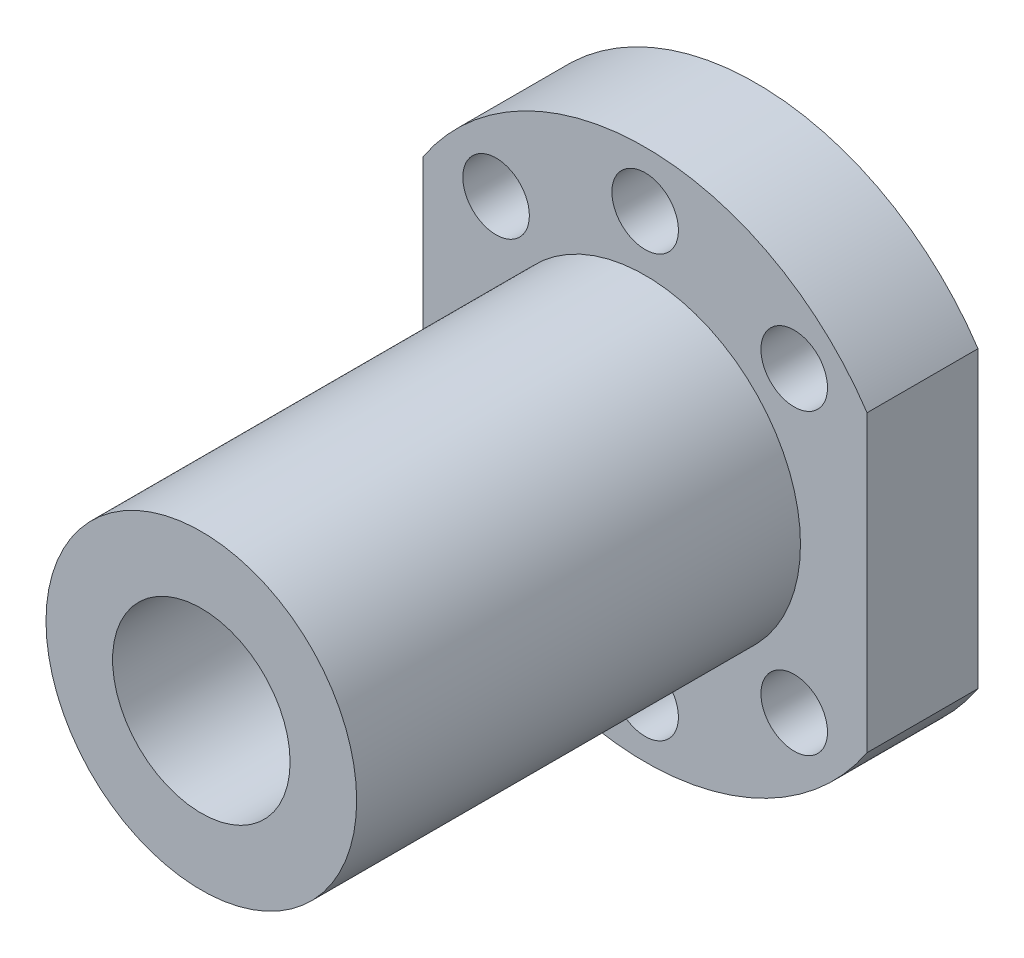
ISO-10303-21;
HEADER;
FILE_DESCRIPTION(('STEP AP214'),'2;1');
FILE_NAME('part.step','',(''),(''),'','','');
FILE_SCHEMA(('AUTOMOTIVE_DESIGN { 1 0 10303 214 1 1 1 1 }'));
ENDSEC;
DATA;
#1=APPLICATION_CONTEXT('core data for automotive mechanical design processes');
#2=APPLICATION_PROTOCOL_DEFINITION('international standard','automotive_design',2000,#1);
#3=PRODUCT_CONTEXT('',#1,'mechanical');
#4=PRODUCT('Part','Part','',(#3));
#5=PRODUCT_RELATED_PRODUCT_CATEGORY('part','',(#4));
#6=PRODUCT_DEFINITION_FORMATION('','',#4);
#7=PRODUCT_DEFINITION_CONTEXT('part definition',#1,'design');
#8=PRODUCT_DEFINITION('design','',#6,#7);
#9=PRODUCT_DEFINITION_SHAPE('','',#8);
#10=(LENGTH_UNIT() NAMED_UNIT(*) SI_UNIT(.MILLI.,.METRE.));
#11=(NAMED_UNIT(*) PLANE_ANGLE_UNIT() SI_UNIT($,.RADIAN.));
#12=(NAMED_UNIT(*) SI_UNIT($,.STERADIAN.) SOLID_ANGLE_UNIT());
#13=UNCERTAINTY_MEASURE_WITH_UNIT(LENGTH_MEASURE(1.E-05),#10,'distance_accuracy_value','');
#14=(GEOMETRIC_REPRESENTATION_CONTEXT(3) GLOBAL_UNCERTAINTY_ASSIGNED_CONTEXT((#13)) GLOBAL_UNIT_ASSIGNED_CONTEXT((#10,
#11,#12)) REPRESENTATION_CONTEXT('',''));
#15=CARTESIAN_POINT('',(0.,0.,0.));
#16=DIRECTION('',(0.,0.,1.));
#17=DIRECTION('',(1.,0.,0.));
#18=AXIS2_PLACEMENT_3D('',#15,#16,#17);
#19=CARTESIAN_POINT('',(-20.,-48.7410098318613,10.));
#20=DIRECTION('',(-1.,0.,0.));
#21=DIRECTION('',(0.,0.,1.));
#22=AXIS2_PLACEMENT_3D('',#19,#20,#21);
#23=PLANE('',#22);
#24=DIRECTION('',(0.,1.,0.));
#25=VECTOR('',#24,1.);
#26=CARTESIAN_POINT('',(-20.,-48.7410098318613,0.));
#27=LINE('',#26,#25);
#28=CARTESIAN_POINT('',(-20.,-13.2664991614216,0.));
#29=VERTEX_POINT('',#28);
#30=CARTESIAN_POINT('',(-20.,13.2664991614216,0.));
#31=VERTEX_POINT('',#30);
#32=EDGE_CURVE('E84',#29,#31,#27,.T.);
#33=ORIENTED_EDGE('',*,*,#32,.F.);
#34=DIRECTION('',(0.,0.,-1.));
#35=VECTOR('',#34,1.);
#36=CARTESIAN_POINT('',(-20.,-13.2664991614216,10.));
#37=LINE('',#36,#35);
#38=CARTESIAN_POINT('',(-20.,-13.2664991614216,10.));
#39=VERTEX_POINT('',#38);
#40=EDGE_CURVE('E11',#39,#29,#37,.T.);
#41=ORIENTED_EDGE('',*,*,#40,.F.);
#42=DIRECTION('',(0.,1.,0.));
#43=VECTOR('',#42,1.);
#44=CARTESIAN_POINT('',(-20.,-48.7410098318613,10.));
#45=LINE('',#44,#43);
#46=CARTESIAN_POINT('',(-20.,13.2664991614216,10.));
#47=VERTEX_POINT('',#46);
#48=EDGE_CURVE('E117',#39,#47,#45,.T.);
#49=ORIENTED_EDGE('',*,*,#48,.T.);
#50=DIRECTION('',(0.,0.,-1.));
#51=VECTOR('',#50,1.);
#52=CARTESIAN_POINT('',(-20.,13.2664991614216,10.));
#53=LINE('',#52,#51);
#54=EDGE_CURVE('E87',#47,#31,#53,.T.);
#55=ORIENTED_EDGE('',*,*,#54,.T.);
#56=EDGE_LOOP('',(#33,#41,#49,#55));
#57=FACE_BOUND('',#56,.T.);
#58=ADVANCED_FACE('F31',(#57),#23,.T.);
#59=CARTESIAN_POINT('',(0.,0.,10.));
#60=DIRECTION('',(0.,0.,-1.));
#61=DIRECTION('',(-1.,0.,0.));
#62=AXIS2_PLACEMENT_3D('',#59,#60,#61);
#63=CYLINDRICAL_SURFACE('',#62,24.);
#64=CARTESIAN_POINT('',(0.,0.,0.));
#65=DIRECTION('',(0.,0.,1.));
#66=DIRECTION('',(1.,0.,0.));
#67=AXIS2_PLACEMENT_3D('',#64,#65,#66);
#68=CIRCLE('',#67,24.);
#69=CARTESIAN_POINT('',(20.,-13.2664991614216,0.));
#70=VERTEX_POINT('',#69);
#71=EDGE_CURVE('E72',#29,#70,#68,.T.);
#72=ORIENTED_EDGE('',*,*,#71,.T.);
#73=DIRECTION('',(0.,0.,-1.));
#74=VECTOR('',#73,1.);
#75=CARTESIAN_POINT('',(20.,-13.2664991614216,10.));
#76=LINE('',#75,#74);
#77=CARTESIAN_POINT('',(20.,-13.2664991614216,10.));
#78=VERTEX_POINT('',#77);
#79=EDGE_CURVE('E38',#78,#70,#76,.T.);
#80=ORIENTED_EDGE('',*,*,#79,.F.);
#81=CARTESIAN_POINT('',(0.,0.,10.));
#82=DIRECTION('',(0.,0.,1.));
#83=DIRECTION('',(1.,0.,0.));
#84=AXIS2_PLACEMENT_3D('',#81,#82,#83);
#85=CIRCLE('',#84,24.);
#86=EDGE_CURVE('E74',#39,#78,#85,.T.);
#87=ORIENTED_EDGE('',*,*,#86,.F.);
#88=ORIENTED_EDGE('',*,*,#40,.T.);
#89=EDGE_LOOP('',(#72,#80,#87,#88));
#90=FACE_BOUND('',#89,.T.);
#91=ADVANCED_FACE('F70',(#90),#63,.T.);
#92=CARTESIAN_POINT('',(20.,-48.7410098318613,10.));
#93=DIRECTION('',(-1.,0.,0.));
#94=DIRECTION('',(0.,0.,1.));
#95=AXIS2_PLACEMENT_3D('',#92,#93,#94);
#96=PLANE('',#95);
#97=DIRECTION('',(0.,1.,0.));
#98=VECTOR('',#97,1.);
#99=CARTESIAN_POINT('',(20.,-48.7410098318613,0.));
#100=LINE('',#99,#98);
#101=CARTESIAN_POINT('',(20.,13.2664991614216,0.));
#102=VERTEX_POINT('',#101);
#103=EDGE_CURVE('E85',#70,#102,#100,.T.);
#104=ORIENTED_EDGE('',*,*,#103,.T.);
#105=DIRECTION('',(0.,0.,-1.));
#106=VECTOR('',#105,1.);
#107=CARTESIAN_POINT('',(20.,13.2664991614216,10.));
#108=LINE('',#107,#106);
#109=CARTESIAN_POINT('',(20.,13.2664991614216,10.));
#110=VERTEX_POINT('',#109);
#111=EDGE_CURVE('E144',#110,#102,#108,.T.);
#112=ORIENTED_EDGE('',*,*,#111,.F.);
#113=DIRECTION('',(0.,1.,0.));
#114=VECTOR('',#113,1.);
#115=CARTESIAN_POINT('',(20.,-48.7410098318613,10.));
#116=LINE('',#115,#114);
#117=EDGE_CURVE('E50',#78,#110,#116,.T.);
#118=ORIENTED_EDGE('',*,*,#117,.F.);
#119=ORIENTED_EDGE('',*,*,#79,.T.);
#120=EDGE_LOOP('',(#104,#112,#118,#119));
#121=FACE_BOUND('',#120,.T.);
#122=ADVANCED_FACE('F147',(#121),#96,.F.);
#123=CARTESIAN_POINT('',(13.4350288425444,-13.4350288425444,10.));
#124=DIRECTION('',(0.,0.,-1.));
#125=DIRECTION('',(-1.,0.,0.));
#126=AXIS2_PLACEMENT_3D('',#123,#124,#125);
#127=CYLINDRICAL_SURFACE('',#126,3.);
#128=CARTESIAN_POINT('',(13.4350288425444,-13.4350288425444,10.));
#129=DIRECTION('',(0.,0.,1.));
#130=DIRECTION('',(1.,0.,0.));
#131=AXIS2_PLACEMENT_3D('',#128,#129,#130);
#132=CIRCLE('',#131,3.);
#133=CARTESIAN_POINT('',(16.4350288425444,-13.4350288425444,10.));
#134=VERTEX_POINT('',#133);
#135=EDGE_CURVE('E137',#134,#134,#132,.T.);
#136=ORIENTED_EDGE('',*,*,#135,.T.);
#137=EDGE_LOOP('',(#136));
#138=FACE_BOUND('',#137,.T.);
#139=CARTESIAN_POINT('',(13.4350288425444,-13.4350288425444,0.));
#140=DIRECTION('',(0.,0.,1.));
#141=DIRECTION('',(1.,0.,0.));
#142=AXIS2_PLACEMENT_3D('',#139,#140,#141);
#143=CIRCLE('',#142,3.);
#144=CARTESIAN_POINT('',(16.4350288425444,-13.4350288425444,0.));
#145=VERTEX_POINT('',#144);
#146=EDGE_CURVE('E111',#145,#145,#143,.T.);
#147=ORIENTED_EDGE('',*,*,#146,.F.);
#148=EDGE_LOOP('',(#147));
#149=FACE_BOUND('',#148,.T.);
#150=ADVANCED_FACE('F205',(#138,#149),#127,.F.);
#151=CARTESIAN_POINT('',(-13.4350288425444,-13.4350288425444,10.));
#152=DIRECTION('',(0.,0.,-1.));
#153=DIRECTION('',(-1.,0.,0.));
#154=AXIS2_PLACEMENT_3D('',#151,#152,#153);
#155=CYLINDRICAL_SURFACE('',#154,3.);
#156=CARTESIAN_POINT('',(-13.4350288425444,-13.4350288425444,10.));
#157=DIRECTION('',(0.,0.,1.));
#158=DIRECTION('',(1.,0.,0.));
#159=AXIS2_PLACEMENT_3D('',#156,#157,#158);
#160=CIRCLE('',#159,3.);
#161=CARTESIAN_POINT('',(-10.4350288425444,-13.4350288425444,10.));
#162=VERTEX_POINT('',#161);
#163=EDGE_CURVE('E134',#162,#162,#160,.T.);
#164=ORIENTED_EDGE('',*,*,#163,.T.);
#165=EDGE_LOOP('',(#164));
#166=FACE_BOUND('',#165,.T.);
#167=CARTESIAN_POINT('',(-13.4350288425444,-13.4350288425444,0.));
#168=DIRECTION('',(0.,0.,1.));
#169=DIRECTION('',(1.,0.,0.));
#170=AXIS2_PLACEMENT_3D('',#167,#168,#169);
#171=CIRCLE('',#170,3.);
#172=CARTESIAN_POINT('',(-10.4350288425444,-13.4350288425444,0.));
#173=VERTEX_POINT('',#172);
#174=EDGE_CURVE('E108',#173,#173,#171,.T.);
#175=ORIENTED_EDGE('',*,*,#174,.F.);
#176=EDGE_LOOP('',(#175));
#177=FACE_BOUND('',#176,.T.);
#178=ADVANCED_FACE('F221',(#166,#177),#155,.F.);
#179=CARTESIAN_POINT('',(13.4350288425444,13.4350288425444,10.));
#180=DIRECTION('',(0.,0.,-1.));
#181=DIRECTION('',(-1.,0.,0.));
#182=AXIS2_PLACEMENT_3D('',#179,#180,#181);
#183=CYLINDRICAL_SURFACE('',#182,3.);
#184=CARTESIAN_POINT('',(13.4350288425444,13.4350288425444,10.));
#185=DIRECTION('',(0.,0.,1.));
#186=DIRECTION('',(1.,0.,0.));
#187=AXIS2_PLACEMENT_3D('',#184,#185,#186);
#188=CIRCLE('',#187,3.);
#189=CARTESIAN_POINT('',(16.4350288425444,13.4350288425444,10.));
#190=VERTEX_POINT('',#189);
#191=EDGE_CURVE('E128',#190,#190,#188,.T.);
#192=ORIENTED_EDGE('',*,*,#191,.T.);
#193=EDGE_LOOP('',(#192));
#194=FACE_BOUND('',#193,.T.);
#195=CARTESIAN_POINT('',(13.4350288425444,13.4350288425444,0.));
#196=DIRECTION('',(0.,0.,1.));
#197=DIRECTION('',(1.,0.,0.));
#198=AXIS2_PLACEMENT_3D('',#195,#196,#197);
#199=CIRCLE('',#198,3.);
#200=CARTESIAN_POINT('',(16.4350288425444,13.4350288425444,0.));
#201=VERTEX_POINT('',#200);
#202=EDGE_CURVE('E105',#201,#201,#199,.T.);
#203=ORIENTED_EDGE('',*,*,#202,.F.);
#204=EDGE_LOOP('',(#203));
#205=FACE_BOUND('',#204,.T.);
#206=ADVANCED_FACE('F217',(#194,#205),#183,.F.);
#207=CARTESIAN_POINT('',(0.,19.,10.));
#208=DIRECTION('',(0.,0.,-1.));
#209=DIRECTION('',(-1.,0.,0.));
#210=AXIS2_PLACEMENT_3D('',#207,#208,#209);
#211=CYLINDRICAL_SURFACE('',#210,3.);
#212=CARTESIAN_POINT('',(0.,19.,10.));
#213=DIRECTION('',(0.,0.,1.));
#214=DIRECTION('',(1.,0.,0.));
#215=AXIS2_PLACEMENT_3D('',#212,#213,#214);
#216=CIRCLE('',#215,3.);
#217=CARTESIAN_POINT('',(3.,19.,10.));
#218=VERTEX_POINT('',#217);
#219=EDGE_CURVE('E125',#218,#218,#216,.T.);
#220=ORIENTED_EDGE('',*,*,#219,.T.);
#221=EDGE_LOOP('',(#220));
#222=FACE_BOUND('',#221,.T.);
#223=CARTESIAN_POINT('',(0.,19.,0.));
#224=DIRECTION('',(0.,0.,1.));
#225=DIRECTION('',(1.,0.,0.));
#226=AXIS2_PLACEMENT_3D('',#223,#224,#225);
#227=CIRCLE('',#226,3.);
#228=CARTESIAN_POINT('',(3.,19.,0.));
#229=VERTEX_POINT('',#228);
#230=EDGE_CURVE('E102',#229,#229,#227,.T.);
#231=ORIENTED_EDGE('',*,*,#230,.F.);
#232=EDGE_LOOP('',(#231));
#233=FACE_BOUND('',#232,.T.);
#234=ADVANCED_FACE('F213',(#222,#233),#211,.F.);
#235=CARTESIAN_POINT('',(-13.4350288425445,13.4350288425444,10.));
#236=DIRECTION('',(0.,0.,-1.));
#237=DIRECTION('',(-1.,0.,0.));
#238=AXIS2_PLACEMENT_3D('',#235,#236,#237);
#239=CYLINDRICAL_SURFACE('',#238,3.);
#240=CARTESIAN_POINT('',(-13.4350288425445,13.4350288425444,10.));
#241=DIRECTION('',(0.,0.,1.));
#242=DIRECTION('',(1.,0.,0.));
#243=AXIS2_PLACEMENT_3D('',#240,#241,#242);
#244=CIRCLE('',#243,3.);
#245=CARTESIAN_POINT('',(-10.4350288425445,13.4350288425444,10.));
#246=VERTEX_POINT('',#245);
#247=EDGE_CURVE('E122',#246,#246,#244,.T.);
#248=ORIENTED_EDGE('',*,*,#247,.T.);
#249=EDGE_LOOP('',(#248));
#250=FACE_BOUND('',#249,.T.);
#251=CARTESIAN_POINT('',(-13.4350288425445,13.4350288425444,0.));
#252=DIRECTION('',(0.,0.,1.));
#253=DIRECTION('',(1.,0.,0.));
#254=AXIS2_PLACEMENT_3D('',#251,#252,#253);
#255=CIRCLE('',#254,3.);
#256=CARTESIAN_POINT('',(-10.4350288425445,13.4350288425444,0.));
#257=VERTEX_POINT('',#256);
#258=EDGE_CURVE('E99',#257,#257,#255,.T.);
#259=ORIENTED_EDGE('',*,*,#258,.F.);
#260=EDGE_LOOP('',(#259));
#261=FACE_BOUND('',#260,.T.);
#262=ADVANCED_FACE('F210',(#250,#261),#239,.F.);
#263=CARTESIAN_POINT('',(0.,0.,10.));
#264=DIRECTION('',(0.,0.,-1.));
#265=DIRECTION('',(-1.,0.,0.));
#266=AXIS2_PLACEMENT_3D('',#263,#264,#265);
#267=CYLINDRICAL_SURFACE('',#266,24.);
#268=CARTESIAN_POINT('',(0.,0.,0.));
#269=DIRECTION('',(0.,0.,1.));
#270=DIRECTION('',(1.,0.,0.));
#271=AXIS2_PLACEMENT_3D('',#268,#269,#270);
#272=CIRCLE('',#271,24.);
#273=EDGE_CURVE('E97',#102,#31,#272,.T.);
#274=ORIENTED_EDGE('',*,*,#273,.T.);
#275=ORIENTED_EDGE('',*,*,#54,.F.);
#276=CARTESIAN_POINT('',(0.,0.,10.));
#277=DIRECTION('',(0.,0.,1.));
#278=DIRECTION('',(1.,0.,0.));
#279=AXIS2_PLACEMENT_3D('',#276,#277,#278);
#280=CIRCLE('',#279,24.);
#281=EDGE_CURVE('E45',#110,#47,#280,.T.);
#282=ORIENTED_EDGE('',*,*,#281,.F.);
#283=ORIENTED_EDGE('',*,*,#111,.T.);
#284=EDGE_LOOP('',(#274,#275,#282,#283));
#285=FACE_BOUND('',#284,.T.);
#286=ADVANCED_FACE('F149',(#285),#267,.T.);
#287=CARTESIAN_POINT('',(0.,-19.,10.));
#288=DIRECTION('',(0.,0.,-1.));
#289=DIRECTION('',(-1.,0.,0.));
#290=AXIS2_PLACEMENT_3D('',#287,#288,#289);
#291=CYLINDRICAL_SURFACE('',#290,3.);
#292=CARTESIAN_POINT('',(0.,-19.,10.));
#293=DIRECTION('',(0.,0.,1.));
#294=DIRECTION('',(1.,0.,0.));
#295=AXIS2_PLACEMENT_3D('',#292,#293,#294);
#296=CIRCLE('',#295,3.);
#297=CARTESIAN_POINT('',(3.,-19.,10.));
#298=VERTEX_POINT('',#297);
#299=EDGE_CURVE('E140',#298,#298,#296,.T.);
#300=ORIENTED_EDGE('',*,*,#299,.T.);
#301=EDGE_LOOP('',(#300));
#302=FACE_BOUND('',#301,.T.);
#303=CARTESIAN_POINT('',(0.,-19.,0.));
#304=DIRECTION('',(0.,0.,1.));
#305=DIRECTION('',(1.,0.,0.));
#306=AXIS2_PLACEMENT_3D('',#303,#304,#305);
#307=CIRCLE('',#306,3.);
#308=CARTESIAN_POINT('',(3.,-19.,0.));
#309=VERTEX_POINT('',#308);
#310=EDGE_CURVE('E114',#309,#309,#307,.T.);
#311=ORIENTED_EDGE('',*,*,#310,.F.);
#312=EDGE_LOOP('',(#311));
#313=FACE_BOUND('',#312,.T.);
#314=ADVANCED_FACE('F153',(#302,#313),#291,.F.);
#315=CARTESIAN_POINT('',(0.,-48.7410098318613,10.));
#316=DIRECTION('',(0.,0.,1.));
#317=DIRECTION('',(1.,0.,0.));
#318=AXIS2_PLACEMENT_3D('',#315,#316,#317);
#319=PLANE('',#318);
#320=ORIENTED_EDGE('',*,*,#48,.F.);
#321=ORIENTED_EDGE('',*,*,#86,.T.);
#322=ORIENTED_EDGE('',*,*,#117,.T.);
#323=ORIENTED_EDGE('',*,*,#281,.T.);
#324=EDGE_LOOP('',(#320,#321,#322,#323));
#325=FACE_BOUND('',#324,.T.);
#326=ORIENTED_EDGE('',*,*,#247,.F.);
#327=EDGE_LOOP('',(#326));
#328=FACE_BOUND('',#327,.T.);
#329=ORIENTED_EDGE('',*,*,#219,.F.);
#330=EDGE_LOOP('',(#329));
#331=FACE_BOUND('',#330,.T.);
#332=ORIENTED_EDGE('',*,*,#191,.F.);
#333=EDGE_LOOP('',(#332));
#334=FACE_BOUND('',#333,.T.);
#335=CARTESIAN_POINT('',(0.,0.,10.));
#336=DIRECTION('',(0.,0.,1.));
#337=DIRECTION('',(1.,0.,0.));
#338=AXIS2_PLACEMENT_3D('',#335,#336,#337);
#339=CIRCLE('',#338,14.);
#340=CARTESIAN_POINT('',(14.,0.,10.));
#341=VERTEX_POINT('',#340);
#342=EDGE_CURVE('E131',#341,#341,#339,.T.);
#343=ORIENTED_EDGE('',*,*,#342,.F.);
#344=EDGE_LOOP('',(#343));
#345=FACE_BOUND('',#344,.T.);
#346=ORIENTED_EDGE('',*,*,#163,.F.);
#347=EDGE_LOOP('',(#346));
#348=FACE_BOUND('',#347,.T.);
#349=ORIENTED_EDGE('',*,*,#135,.F.);
#350=EDGE_LOOP('',(#349));
#351=FACE_BOUND('',#350,.T.);
#352=ORIENTED_EDGE('',*,*,#299,.F.);
#353=EDGE_LOOP('',(#352));
#354=FACE_BOUND('',#353,.T.);
#355=ADVANCED_FACE('F150',(#325,#328,#331,#334,#345,#348,#351,#354),#319,.T.);
#356=CARTESIAN_POINT('',(0.,-48.7410098318613,0.));
#357=DIRECTION('',(0.,0.,1.));
#358=DIRECTION('',(1.,0.,0.));
#359=AXIS2_PLACEMENT_3D('',#356,#357,#358);
#360=PLANE('',#359);
#361=ORIENTED_EDGE('',*,*,#32,.T.);
#362=ORIENTED_EDGE('',*,*,#273,.F.);
#363=ORIENTED_EDGE('',*,*,#103,.F.);
#364=ORIENTED_EDGE('',*,*,#71,.F.);
#365=EDGE_LOOP('',(#361,#362,#363,#364));
#366=FACE_BOUND('',#365,.T.);
#367=ORIENTED_EDGE('',*,*,#258,.T.);
#368=EDGE_LOOP('',(#367));
#369=FACE_BOUND('',#368,.T.);
#370=ORIENTED_EDGE('',*,*,#230,.T.);
#371=EDGE_LOOP('',(#370));
#372=FACE_BOUND('',#371,.T.);
#373=ORIENTED_EDGE('',*,*,#202,.T.);
#374=EDGE_LOOP('',(#373));
#375=FACE_BOUND('',#374,.T.);
#376=ORIENTED_EDGE('',*,*,#174,.T.);
#377=EDGE_LOOP('',(#376));
#378=FACE_BOUND('',#377,.T.);
#379=ORIENTED_EDGE('',*,*,#146,.T.);
#380=EDGE_LOOP('',(#379));
#381=FACE_BOUND('',#380,.T.);
#382=ORIENTED_EDGE('',*,*,#310,.T.);
#383=EDGE_LOOP('',(#382));
#384=FACE_BOUND('',#383,.T.);
#385=CARTESIAN_POINT('',(0.,0.,0.));
#386=DIRECTION('',(0.,0.,1.));
#387=DIRECTION('',(1.,0.,0.));
#388=AXIS2_PLACEMENT_3D('',#385,#386,#387);
#389=CIRCLE('',#388,8.);
#390=CARTESIAN_POINT('',(8.,0.,0.));
#391=VERTEX_POINT('',#390);
#392=EDGE_CURVE('E180',#391,#391,#389,.T.);
#393=ORIENTED_EDGE('',*,*,#392,.T.);
#394=EDGE_LOOP('',(#393));
#395=FACE_BOUND('',#394,.T.);
#396=ADVANCED_FACE('F81',(#366,#369,#372,#375,#378,#381,#384,#395),#360,.F.);
#397=CARTESIAN_POINT('',(0.,0.,50.));
#398=DIRECTION('',(0.,0.,-1.));
#399=DIRECTION('',(-1.,0.,0.));
#400=AXIS2_PLACEMENT_3D('',#397,#398,#399);
#401=CYLINDRICAL_SURFACE('',#400,14.);
#402=ORIENTED_EDGE('',*,*,#342,.T.);
#403=EDGE_LOOP('',(#402));
#404=FACE_BOUND('',#403,.T.);
#405=CARTESIAN_POINT('',(0.,0.,50.));
#406=DIRECTION('',(0.,0.,1.));
#407=DIRECTION('',(1.,0.,0.));
#408=AXIS2_PLACEMENT_3D('',#405,#406,#407);
#409=CIRCLE('',#408,14.);
#410=CARTESIAN_POINT('',(14.,0.,50.));
#411=VERTEX_POINT('',#410);
#412=EDGE_CURVE('E92',#411,#411,#409,.T.);
#413=ORIENTED_EDGE('',*,*,#412,.F.);
#414=EDGE_LOOP('',(#413));
#415=FACE_BOUND('',#414,.T.);
#416=ADVANCED_FACE('F176',(#404,#415),#401,.T.);
#417=CARTESIAN_POINT('',(0.,0.,50.));
#418=DIRECTION('',(0.,0.,-1.));
#419=DIRECTION('',(-1.,0.,0.));
#420=AXIS2_PLACEMENT_3D('',#417,#418,#419);
#421=CYLINDRICAL_SURFACE('',#420,8.);
#422=CARTESIAN_POINT('',(0.,0.,50.));
#423=DIRECTION('',(0.,0.,1.));
#424=DIRECTION('',(1.,0.,0.));
#425=AXIS2_PLACEMENT_3D('',#422,#423,#424);
#426=CIRCLE('',#425,8.);
#427=CARTESIAN_POINT('',(8.,0.,50.));
#428=VERTEX_POINT('',#427);
#429=EDGE_CURVE('E89',#428,#428,#426,.T.);
#430=ORIENTED_EDGE('',*,*,#429,.T.);
#431=EDGE_LOOP('',(#430));
#432=FACE_BOUND('',#431,.T.);
#433=ORIENTED_EDGE('',*,*,#392,.F.);
#434=EDGE_LOOP('',(#433));
#435=FACE_BOUND('',#434,.T.);
#436=ADVANCED_FACE('F190',(#432,#435),#421,.F.);
#437=CARTESIAN_POINT('',(0.,-48.7410098318613,50.));
#438=DIRECTION('',(0.,0.,1.));
#439=DIRECTION('',(1.,0.,0.));
#440=AXIS2_PLACEMENT_3D('',#437,#438,#439);
#441=PLANE('',#440);
#442=ORIENTED_EDGE('',*,*,#412,.T.);
#443=EDGE_LOOP('',(#442));
#444=FACE_BOUND('',#443,.T.);
#445=ORIENTED_EDGE('',*,*,#429,.F.);
#446=EDGE_LOOP('',(#445));
#447=FACE_BOUND('',#446,.T.);
#448=ADVANCED_FACE('F186',(#444,#447),#441,.T.);
#449=CLOSED_SHELL('',(#58,#91,#122,#150,#178,#206,#234,#262,#286,#314,#355,#396,#416,#436,#448));
#450=MANIFOLD_SOLID_BREP('B2',#449);
#451=ADVANCED_BREP_SHAPE_REPRESENTATION('',(#18,#450),#14);
#452=SHAPE_DEFINITION_REPRESENTATION(#9,#451);
ENDSEC;
END-ISO-10303-21;
